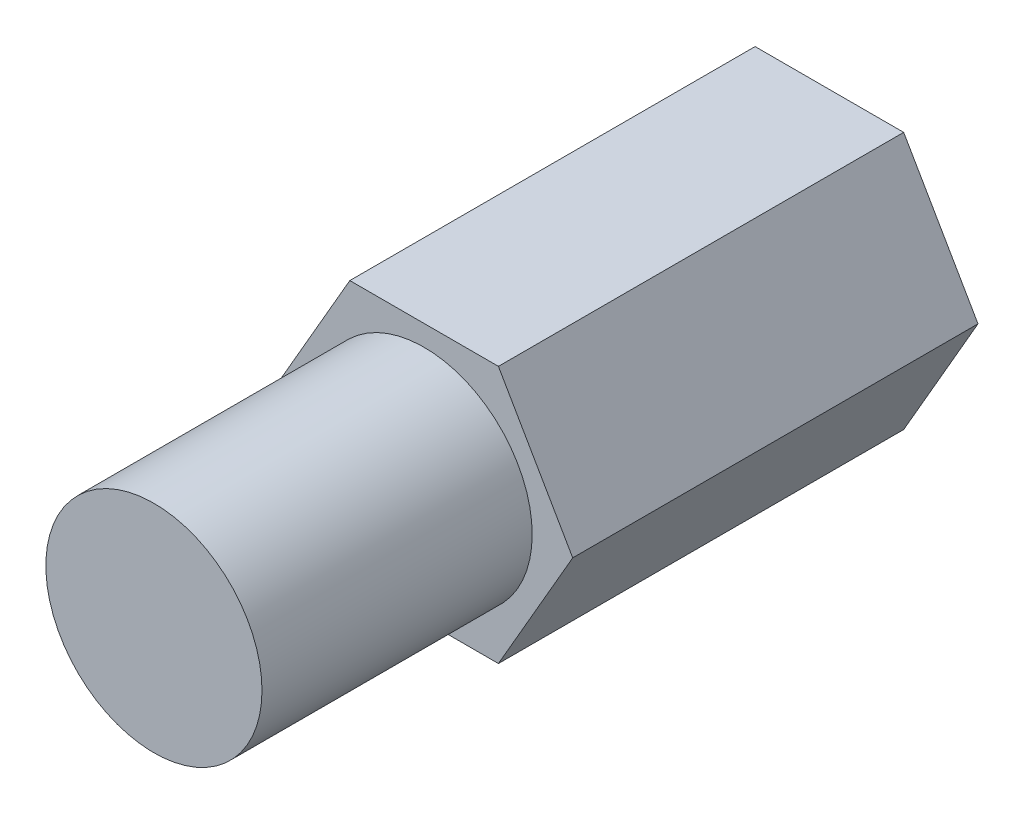
ISO-10303-21;
HEADER;
FILE_DESCRIPTION(('STEP AP214'),'2;1');
FILE_NAME('part.step','',(''),(''),'','','');
FILE_SCHEMA(('AUTOMOTIVE_DESIGN { 1 0 10303 214 1 1 1 1 }'));
ENDSEC;
DATA;
#1=APPLICATION_CONTEXT('core data for automotive mechanical design processes');
#2=APPLICATION_PROTOCOL_DEFINITION('international standard','automotive_design',2000,#1);
#3=PRODUCT_CONTEXT('',#1,'mechanical');
#4=PRODUCT('Part','Part','',(#3));
#5=PRODUCT_RELATED_PRODUCT_CATEGORY('part','',(#4));
#6=PRODUCT_DEFINITION_FORMATION('','',#4);
#7=PRODUCT_DEFINITION_CONTEXT('part definition',#1,'design');
#8=PRODUCT_DEFINITION('design','',#6,#7);
#9=PRODUCT_DEFINITION_SHAPE('','',#8);
#10=(LENGTH_UNIT() NAMED_UNIT(*) SI_UNIT(.MILLI.,.METRE.));
#11=(NAMED_UNIT(*) PLANE_ANGLE_UNIT() SI_UNIT($,.RADIAN.));
#12=(NAMED_UNIT(*) SI_UNIT($,.STERADIAN.) SOLID_ANGLE_UNIT());
#13=UNCERTAINTY_MEASURE_WITH_UNIT(LENGTH_MEASURE(1.E-05),#10,'distance_accuracy_value','');
#14=(GEOMETRIC_REPRESENTATION_CONTEXT(3) GLOBAL_UNCERTAINTY_ASSIGNED_CONTEXT((#13)) GLOBAL_UNIT_ASSIGNED_CONTEXT((#10,
#11,#12)) REPRESENTATION_CONTEXT('',''));
#15=CARTESIAN_POINT('',(0.,0.,0.));
#16=DIRECTION('',(0.,0.,1.));
#17=DIRECTION('',(1.,0.,0.));
#18=AXIS2_PLACEMENT_3D('',#15,#16,#17);
#19=CARTESIAN_POINT('',(-5.5,0.,15.));
#20=DIRECTION('',(0.,0.,1.));
#21=DIRECTION('',(1.,0.,0.));
#22=AXIS2_PLACEMENT_3D('',#19,#20,#21);
#23=PLANE('',#22);
#24=DIRECTION('',(-0.5,-0.866025403784439,0.));
#25=VECTOR('',#24,1.);
#26=CARTESIAN_POINT('',(-2.75,4.76313972081441,15.));
#27=LINE('',#26,#25);
#28=CARTESIAN_POINT('',(-2.75,4.76313972081441,15.));
#29=VERTEX_POINT('',#28);
#30=CARTESIAN_POINT('',(-5.5,0.,15.));
#31=VERTEX_POINT('',#30);
#32=EDGE_CURVE('E129',#29,#31,#27,.T.);
#33=ORIENTED_EDGE('',*,*,#32,.T.);
#34=DIRECTION('',(0.5,-0.866025403784438,0.));
#35=VECTOR('',#34,1.);
#36=CARTESIAN_POINT('',(-5.5,0.,15.));
#37=LINE('',#36,#35);
#38=CARTESIAN_POINT('',(-2.75,-4.76313972081441,15.));
#39=VERTEX_POINT('',#38);
#40=EDGE_CURVE('E87',#31,#39,#37,.T.);
#41=ORIENTED_EDGE('',*,*,#40,.T.);
#42=DIRECTION('',(1.,0.,0.));
#43=VECTOR('',#42,1.);
#44=CARTESIAN_POINT('',(-2.75,-4.76313972081441,15.));
#45=LINE('',#44,#43);
#46=CARTESIAN_POINT('',(2.75,-4.76313972081441,15.));
#47=VERTEX_POINT('',#46);
#48=EDGE_CURVE('E100',#39,#47,#45,.T.);
#49=ORIENTED_EDGE('',*,*,#48,.T.);
#50=DIRECTION('',(0.5,0.866025403784439,0.));
#51=VECTOR('',#50,1.);
#52=CARTESIAN_POINT('',(2.75,-4.76313972081441,15.));
#53=LINE('',#52,#51);
#54=CARTESIAN_POINT('',(5.5,0.,15.));
#55=VERTEX_POINT('',#54);
#56=EDGE_CURVE('E94',#47,#55,#53,.T.);
#57=ORIENTED_EDGE('',*,*,#56,.T.);
#58=DIRECTION('',(-0.5,0.866025403784439,0.));
#59=VECTOR('',#58,1.);
#60=CARTESIAN_POINT('',(5.5,0.,15.));
#61=LINE('',#60,#59);
#62=CARTESIAN_POINT('',(2.75,4.76313972081441,15.));
#63=VERTEX_POINT('',#62);
#64=EDGE_CURVE('E98',#55,#63,#61,.T.);
#65=ORIENTED_EDGE('',*,*,#64,.T.);
#66=DIRECTION('',(-1.,0.,0.));
#67=VECTOR('',#66,1.);
#68=CARTESIAN_POINT('',(2.75,4.76313972081441,15.));
#69=LINE('',#68,#67);
#70=EDGE_CURVE('E50',#63,#29,#69,.T.);
#71=ORIENTED_EDGE('',*,*,#70,.T.);
#72=EDGE_LOOP('',(#33,#41,#49,#57,#65,#71));
#73=FACE_BOUND('',#72,.T.);
#74=CARTESIAN_POINT('',(0.,0.,15.));
#75=DIRECTION('',(0.,0.,1.));
#76=DIRECTION('',(1.,0.,0.));
#77=AXIS2_PLACEMENT_3D('',#74,#75,#76);
#78=CIRCLE('',#77,4.);
#79=CARTESIAN_POINT('',(4.,0.,15.));
#80=VERTEX_POINT('',#79);
#81=EDGE_CURVE('E169',#80,#80,#78,.T.);
#82=ORIENTED_EDGE('',*,*,#81,.F.);
#83=EDGE_LOOP('',(#82));
#84=FACE_BOUND('',#83,.T.);
#85=ADVANCED_FACE('F33',(#73,#84),#23,.T.);
#86=CARTESIAN_POINT('',(-2.75,4.76313972081441,15.));
#87=DIRECTION('',(0.866025403784439,-0.5,0.));
#88=DIRECTION('',(0.5,0.866025403784439,0.));
#89=AXIS2_PLACEMENT_3D('',#86,#87,#88);
#90=PLANE('',#89);
#91=DIRECTION('',(-0.5,-0.866025403784439,0.));
#92=VECTOR('',#91,1.);
#93=CARTESIAN_POINT('',(-2.75,4.76313972081441,0.));
#94=LINE('',#93,#92);
#95=CARTESIAN_POINT('',(-2.75,4.76313972081441,0.));
#96=VERTEX_POINT('',#95);
#97=CARTESIAN_POINT('',(-5.5,0.,0.));
#98=VERTEX_POINT('',#97);
#99=EDGE_CURVE('E118',#96,#98,#94,.T.);
#100=ORIENTED_EDGE('',*,*,#99,.T.);
#101=DIRECTION('',(0.,0.,-1.));
#102=VECTOR('',#101,1.);
#103=CARTESIAN_POINT('',(-5.5,0.,15.));
#104=LINE('',#103,#102);
#105=EDGE_CURVE('E11',#31,#98,#104,.T.);
#106=ORIENTED_EDGE('',*,*,#105,.F.);
#107=ORIENTED_EDGE('',*,*,#32,.F.);
#108=DIRECTION('',(0.,0.,-1.));
#109=VECTOR('',#108,1.);
#110=CARTESIAN_POINT('',(-2.75,4.76313972081441,15.));
#111=LINE('',#110,#109);
#112=EDGE_CURVE('E114',#29,#96,#111,.T.);
#113=ORIENTED_EDGE('',*,*,#112,.T.);
#114=EDGE_LOOP('',(#100,#106,#107,#113));
#115=FACE_BOUND('',#114,.T.);
#116=ADVANCED_FACE('F35',(#115),#90,.F.);
#117=CARTESIAN_POINT('',(-5.5,0.,15.));
#118=DIRECTION('',(0.866025403784438,0.5,0.));
#119=DIRECTION('',(-0.5,0.866025403784439,0.));
#120=AXIS2_PLACEMENT_3D('',#117,#118,#119);
#121=PLANE('',#120);
#122=DIRECTION('',(0.5,-0.866025403784438,0.));
#123=VECTOR('',#122,1.);
#124=CARTESIAN_POINT('',(-5.5,0.,0.));
#125=LINE('',#124,#123);
#126=CARTESIAN_POINT('',(-2.75,-4.76313972081441,0.));
#127=VERTEX_POINT('',#126);
#128=EDGE_CURVE('E121',#98,#127,#125,.T.);
#129=ORIENTED_EDGE('',*,*,#128,.T.);
#130=DIRECTION('',(0.,0.,-1.));
#131=VECTOR('',#130,1.);
#132=CARTESIAN_POINT('',(-2.75,-4.76313972081441,15.));
#133=LINE('',#132,#131);
#134=EDGE_CURVE('E42',#39,#127,#133,.T.);
#135=ORIENTED_EDGE('',*,*,#134,.F.);
#136=ORIENTED_EDGE('',*,*,#40,.F.);
#137=ORIENTED_EDGE('',*,*,#105,.T.);
#138=EDGE_LOOP('',(#129,#135,#136,#137));
#139=FACE_BOUND('',#138,.T.);
#140=ADVANCED_FACE('F157',(#139),#121,.F.);
#141=CARTESIAN_POINT('',(-2.75,-4.76313972081441,15.));
#142=DIRECTION('',(0.,1.,0.));
#143=DIRECTION('',(0.,0.,1.));
#144=AXIS2_PLACEMENT_3D('',#141,#142,#143);
#145=PLANE('',#144);
#146=DIRECTION('',(1.,0.,0.));
#147=VECTOR('',#146,1.);
#148=CARTESIAN_POINT('',(-2.75,-4.76313972081441,0.));
#149=LINE('',#148,#147);
#150=CARTESIAN_POINT('',(2.75,-4.76313972081441,0.));
#151=VERTEX_POINT('',#150);
#152=EDGE_CURVE('E124',#127,#151,#149,.T.);
#153=ORIENTED_EDGE('',*,*,#152,.T.);
#154=DIRECTION('',(0.,0.,-1.));
#155=VECTOR('',#154,1.);
#156=CARTESIAN_POINT('',(2.75,-4.76313972081441,15.));
#157=LINE('',#156,#155);
#158=EDGE_CURVE('E109',#47,#151,#157,.T.);
#159=ORIENTED_EDGE('',*,*,#158,.F.);
#160=ORIENTED_EDGE('',*,*,#48,.F.);
#161=ORIENTED_EDGE('',*,*,#134,.T.);
#162=EDGE_LOOP('',(#153,#159,#160,#161));
#163=FACE_BOUND('',#162,.T.);
#164=ADVANCED_FACE('F135',(#163),#145,.F.);
#165=CARTESIAN_POINT('',(2.75,-4.76313972081441,15.));
#166=DIRECTION('',(-0.866025403784439,0.5,0.));
#167=DIRECTION('',(-0.5,-0.866025403784439,0.));
#168=AXIS2_PLACEMENT_3D('',#165,#166,#167);
#169=PLANE('',#168);
#170=DIRECTION('',(0.5,0.866025403784439,0.));
#171=VECTOR('',#170,1.);
#172=CARTESIAN_POINT('',(2.75,-4.76313972081441,0.));
#173=LINE('',#172,#171);
#174=CARTESIAN_POINT('',(5.5,0.,0.));
#175=VERTEX_POINT('',#174);
#176=EDGE_CURVE('E108',#151,#175,#173,.T.);
#177=ORIENTED_EDGE('',*,*,#176,.T.);
#178=DIRECTION('',(0.,0.,-1.));
#179=VECTOR('',#178,1.);
#180=CARTESIAN_POINT('',(5.5,0.,15.));
#181=LINE('',#180,#179);
#182=EDGE_CURVE('E105',#55,#175,#181,.T.);
#183=ORIENTED_EDGE('',*,*,#182,.F.);
#184=ORIENTED_EDGE('',*,*,#56,.F.);
#185=ORIENTED_EDGE('',*,*,#158,.T.);
#186=EDGE_LOOP('',(#177,#183,#184,#185));
#187=FACE_BOUND('',#186,.T.);
#188=ADVANCED_FACE('F106',(#187),#169,.F.);
#189=CARTESIAN_POINT('',(5.5,0.,15.));
#190=DIRECTION('',(-0.866025403784438,-0.5,0.));
#191=DIRECTION('',(0.5,-0.866025403784439,0.));
#192=AXIS2_PLACEMENT_3D('',#189,#190,#191);
#193=PLANE('',#192);
#194=DIRECTION('',(-0.5,0.866025403784439,0.));
#195=VECTOR('',#194,1.);
#196=CARTESIAN_POINT('',(5.5,0.,0.));
#197=LINE('',#196,#195);
#198=CARTESIAN_POINT('',(2.75,4.76313972081441,0.));
#199=VERTEX_POINT('',#198);
#200=EDGE_CURVE('E73',#175,#199,#197,.T.);
#201=ORIENTED_EDGE('',*,*,#200,.T.);
#202=DIRECTION('',(0.,0.,-1.));
#203=VECTOR('',#202,1.);
#204=CARTESIAN_POINT('',(2.75,4.76313972081441,15.));
#205=LINE('',#204,#203);
#206=EDGE_CURVE('E110',#63,#199,#205,.T.);
#207=ORIENTED_EDGE('',*,*,#206,.F.);
#208=ORIENTED_EDGE('',*,*,#64,.F.);
#209=ORIENTED_EDGE('',*,*,#182,.T.);
#210=EDGE_LOOP('',(#201,#207,#208,#209));
#211=FACE_BOUND('',#210,.T.);
#212=ADVANCED_FACE('F112',(#211),#193,.F.);
#213=CARTESIAN_POINT('',(2.75,4.76313972081441,15.));
#214=DIRECTION('',(0.,-1.,0.));
#215=DIRECTION('',(1.,0.,0.));
#216=AXIS2_PLACEMENT_3D('',#213,#214,#215);
#217=PLANE('',#216);
#218=DIRECTION('',(-1.,0.,0.));
#219=VECTOR('',#218,1.);
#220=CARTESIAN_POINT('',(2.75,4.76313972081441,0.));
#221=LINE('',#220,#219);
#222=EDGE_CURVE('E79',#199,#96,#221,.T.);
#223=ORIENTED_EDGE('',*,*,#222,.T.);
#224=ORIENTED_EDGE('',*,*,#112,.F.);
#225=ORIENTED_EDGE('',*,*,#70,.F.);
#226=ORIENTED_EDGE('',*,*,#206,.T.);
#227=EDGE_LOOP('',(#223,#224,#225,#226));
#228=FACE_BOUND('',#227,.T.);
#229=ADVANCED_FACE('F142',(#228),#217,.F.);
#230=CARTESIAN_POINT('',(-5.5,0.,0.));
#231=DIRECTION('',(0.,0.,1.));
#232=DIRECTION('',(1.,0.,0.));
#233=AXIS2_PLACEMENT_3D('',#230,#231,#232);
#234=PLANE('',#233);
#235=ORIENTED_EDGE('',*,*,#99,.F.);
#236=ORIENTED_EDGE('',*,*,#222,.F.);
#237=ORIENTED_EDGE('',*,*,#200,.F.);
#238=ORIENTED_EDGE('',*,*,#176,.F.);
#239=ORIENTED_EDGE('',*,*,#152,.F.);
#240=ORIENTED_EDGE('',*,*,#128,.F.);
#241=EDGE_LOOP('',(#235,#236,#237,#238,#239,#240));
#242=FACE_BOUND('',#241,.T.);
#243=ADVANCED_FACE('F138',(#242),#234,.F.);
#244=CARTESIAN_POINT('',(0.,0.,25.));
#245=DIRECTION('',(0.,0.,-1.));
#246=DIRECTION('',(-1.,0.,0.));
#247=AXIS2_PLACEMENT_3D('',#244,#245,#246);
#248=CYLINDRICAL_SURFACE('',#247,4.);
#249=CARTESIAN_POINT('',(0.,0.,25.));
#250=DIRECTION('',(0.,0.,1.));
#251=DIRECTION('',(1.,0.,0.));
#252=AXIS2_PLACEMENT_3D('',#249,#250,#251);
#253=CIRCLE('',#252,4.);
#254=CARTESIAN_POINT('',(4.,0.,25.));
#255=VERTEX_POINT('',#254);
#256=EDGE_CURVE('E122',#255,#255,#253,.T.);
#257=ORIENTED_EDGE('',*,*,#256,.F.);
#258=EDGE_LOOP('',(#257));
#259=FACE_BOUND('',#258,.T.);
#260=ORIENTED_EDGE('',*,*,#81,.T.);
#261=EDGE_LOOP('',(#260));
#262=FACE_BOUND('',#261,.T.);
#263=ADVANCED_FACE('F149',(#259,#262),#248,.T.);
#264=CARTESIAN_POINT('',(0.,0.,25.));
#265=DIRECTION('',(0.,0.,1.));
#266=DIRECTION('',(1.,0.,0.));
#267=AXIS2_PLACEMENT_3D('',#264,#265,#266);
#268=PLANE('',#267);
#269=ORIENTED_EDGE('',*,*,#256,.T.);
#270=EDGE_LOOP('',(#269));
#271=FACE_BOUND('',#270,.T.);
#272=ADVANCED_FACE('F161',(#271),#268,.T.);
#273=CLOSED_SHELL('',(#85,#116,#140,#164,#188,#212,#229,#243,#263,#272));
#274=MANIFOLD_SOLID_BREP('B2',#273);
#275=ADVANCED_BREP_SHAPE_REPRESENTATION('',(#18,#274),#14);
#276=SHAPE_DEFINITION_REPRESENTATION(#9,#275);
ENDSEC;
END-ISO-10303-21;
